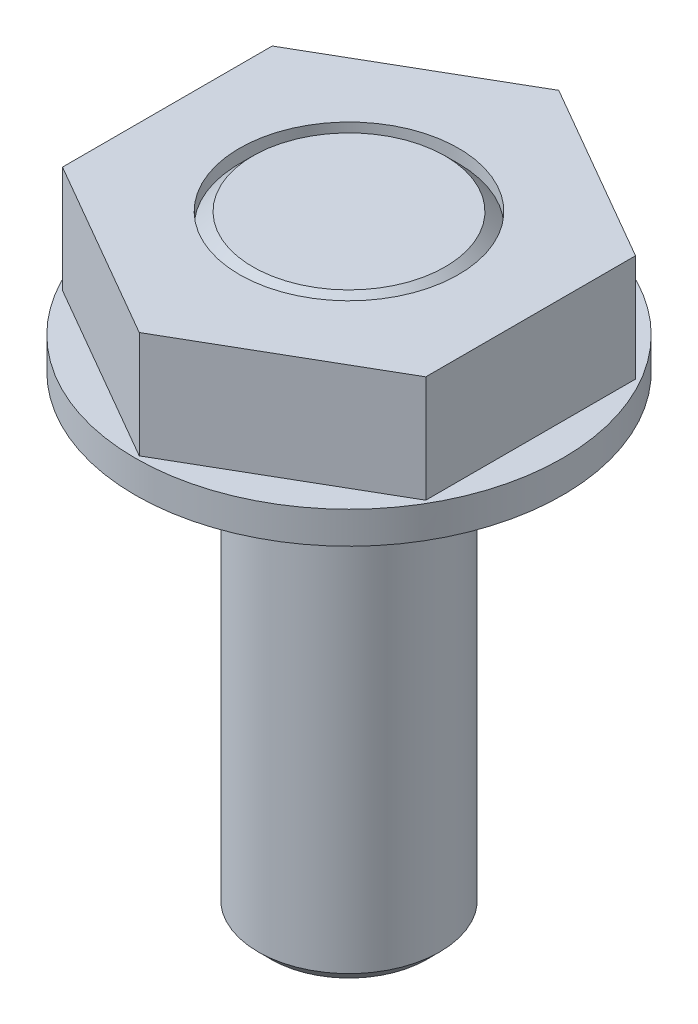
ISO-10303-21;
HEADER;
FILE_DESCRIPTION(('STEP AP214'),'2;1');
FILE_NAME('part.step','',(''),(''),'','','');
FILE_SCHEMA(('AUTOMOTIVE_DESIGN { 1 0 10303 214 1 1 1 1 }'));
ENDSEC;
DATA;
#1=APPLICATION_CONTEXT('core data for automotive mechanical design processes');
#2=APPLICATION_PROTOCOL_DEFINITION('international standard','automotive_design',2000,#1);
#3=PRODUCT_CONTEXT('',#1,'mechanical');
#4=PRODUCT('Part','Part','',(#3));
#5=PRODUCT_RELATED_PRODUCT_CATEGORY('part','',(#4));
#6=PRODUCT_DEFINITION_FORMATION('','',#4);
#7=PRODUCT_DEFINITION_CONTEXT('part definition',#1,'design');
#8=PRODUCT_DEFINITION('design','',#6,#7);
#9=PRODUCT_DEFINITION_SHAPE('','',#8);
#10=(LENGTH_UNIT() NAMED_UNIT(*) SI_UNIT(.MILLI.,.METRE.));
#11=(NAMED_UNIT(*) PLANE_ANGLE_UNIT() SI_UNIT($,.RADIAN.));
#12=(NAMED_UNIT(*) SI_UNIT($,.STERADIAN.) SOLID_ANGLE_UNIT());
#13=UNCERTAINTY_MEASURE_WITH_UNIT(LENGTH_MEASURE(1.E-05),#10,'distance_accuracy_value','');
#14=(GEOMETRIC_REPRESENTATION_CONTEXT(3) GLOBAL_UNCERTAINTY_ASSIGNED_CONTEXT((#13)) GLOBAL_UNIT_ASSIGNED_CONTEXT((#10,
#11,#12)) REPRESENTATION_CONTEXT('',''));
#15=CARTESIAN_POINT('',(0.,0.,0.));
#16=DIRECTION('',(0.,0.,1.));
#17=DIRECTION('',(1.,0.,0.));
#18=AXIS2_PLACEMENT_3D('',#15,#16,#17);
#19=CARTESIAN_POINT('',(-10.2732395765881,0.,-10.));
#20=DIRECTION('',(0.,-1.,0.));
#21=DIRECTION('',(1.,0.,0.));
#22=AXIS2_PLACEMENT_3D('',#19,#20,#21);
#23=PLANE('',#22);
#24=CARTESIAN_POINT('',(0.,0.,0.));
#25=DIRECTION('',(0.,-1.,0.));
#26=DIRECTION('',(0.,0.,1.));
#27=AXIS2_PLACEMENT_3D('',#24,#25,#26);
#28=CIRCLE('',#27,10.);
#29=CARTESIAN_POINT('',(0.,0.,10.));
#30=VERTEX_POINT('',#29);
#31=EDGE_CURVE('E181',#30,#30,#28,.T.);
#32=ORIENTED_EDGE('',*,*,#31,.T.);
#33=EDGE_LOOP('',(#32));
#34=FACE_BOUND('',#33,.T.);
#35=CARTESIAN_POINT('',(0.,0.,0.));
#36=DIRECTION('',(0.,1.,0.));
#37=DIRECTION('',(0.,0.,-1.));
#38=AXIS2_PLACEMENT_3D('',#35,#36,#37);
#39=CIRCLE('',#38,4.25);
#40=CARTESIAN_POINT('',(0.,0.,-4.25));
#41=VERTEX_POINT('',#40);
#42=EDGE_CURVE('E179',#41,#41,#39,.F.);
#43=ORIENTED_EDGE('',*,*,#42,.F.);
#44=EDGE_LOOP('',(#43));
#45=FACE_BOUND('',#44,.T.);
#46=ADVANCED_FACE('F16',(#34,#45),#23,.T.);
#47=CARTESIAN_POINT('',(-3.6365,-22.,-3.6365));
#48=DIRECTION('',(0.,-1.,0.));
#49=DIRECTION('',(1.,0.,0.));
#50=AXIS2_PLACEMENT_3D('',#47,#48,#49);
#51=PLANE('',#50);
#52=CARTESIAN_POINT('',(0.,-22.,0.));
#53=DIRECTION('',(0.,-1.,0.));
#54=DIRECTION('',(0.,0.,1.));
#55=AXIS2_PLACEMENT_3D('',#52,#53,#54);
#56=CIRCLE('',#55,3.6365);
#57=CARTESIAN_POINT('',(0.,-22.,3.6365));
#58=VERTEX_POINT('',#57);
#59=EDGE_CURVE('E96',#58,#58,#56,.T.);
#60=ORIENTED_EDGE('',*,*,#59,.T.);
#61=EDGE_LOOP('',(#60));
#62=FACE_BOUND('',#61,.T.);
#63=ADVANCED_FACE('F196',(#62),#51,.T.);
#64=CARTESIAN_POINT('',(-10.2732395705885,1.5,-10.));
#65=DIRECTION('',(0.,1.,0.));
#66=DIRECTION('',(0.,0.,1.));
#67=AXIS2_PLACEMENT_3D('',#64,#65,#66);
#68=PLANE('',#67);
#69=CARTESIAN_POINT('',(0.,1.5,0.));
#70=DIRECTION('',(0.,1.,0.));
#71=DIRECTION('',(0.,0.,-1.));
#72=AXIS2_PLACEMENT_3D('',#69,#70,#71);
#73=CIRCLE('',#72,10.);
#74=CARTESIAN_POINT('',(0.,1.5,-10.));
#75=VERTEX_POINT('',#74);
#76=EDGE_CURVE('E93',#75,#75,#73,.T.);
#77=ORIENTED_EDGE('',*,*,#76,.T.);
#78=EDGE_LOOP('',(#77));
#79=FACE_BOUND('',#78,.T.);
#80=DIRECTION('',(0.,0.,-1.));
#81=VECTOR('',#80,1.);
#82=CARTESIAN_POINT('',(-8.5,1.5,4.9074772881118));
#83=LINE('',#82,#81);
#84=CARTESIAN_POINT('',(-8.5,1.5,-4.9074772881118));
#85=VERTEX_POINT('',#84);
#86=CARTESIAN_POINT('',(-8.5,1.5,4.9074772881118));
#87=VERTEX_POINT('',#86);
#88=EDGE_CURVE('E79',#85,#87,#83,.F.);
#89=ORIENTED_EDGE('',*,*,#88,.F.);
#90=DIRECTION('',(0.866025403784439,0.,-0.499999999999999));
#91=VECTOR('',#90,1.);
#92=CARTESIAN_POINT('',(-8.5,1.5,-4.90747728811179));
#93=LINE('',#92,#91);
#94=CARTESIAN_POINT('',(0.,1.5,-9.8149545762236));
#95=VERTEX_POINT('',#94);
#96=EDGE_CURVE('E68',#95,#85,#93,.F.);
#97=ORIENTED_EDGE('',*,*,#96,.F.);
#98=DIRECTION('',(0.866025403784439,0.,0.499999999999999));
#99=VECTOR('',#98,1.);
#100=CARTESIAN_POINT('',(0.,1.5,-9.81495457622361));
#101=LINE('',#100,#99);
#102=CARTESIAN_POINT('',(8.50000000000001,1.5,-4.9074772881118));
#103=VERTEX_POINT('',#102);
#104=EDGE_CURVE('E78',#103,#95,#101,.F.);
#105=ORIENTED_EDGE('',*,*,#104,.F.);
#106=DIRECTION('',(0.,0.,1.));
#107=VECTOR('',#106,1.);
#108=CARTESIAN_POINT('',(8.50000000000001,1.5,-4.9074772881118));
#109=LINE('',#108,#107);
#110=CARTESIAN_POINT('',(8.50000000000001,1.5,4.9074772881118));
#111=VERTEX_POINT('',#110);
#112=EDGE_CURVE('E105',#111,#103,#109,.F.);
#113=ORIENTED_EDGE('',*,*,#112,.F.);
#114=DIRECTION('',(-0.866025403784439,0.,0.499999999999999));
#115=VECTOR('',#114,1.);
#116=CARTESIAN_POINT('',(8.49999999999999,1.5,4.90747728811179));
#117=LINE('',#116,#115);
#118=CARTESIAN_POINT('',(0.,1.5,9.8149545762236));
#119=VERTEX_POINT('',#118);
#120=EDGE_CURVE('E109',#119,#111,#117,.F.);
#121=ORIENTED_EDGE('',*,*,#120,.F.);
#122=DIRECTION('',(-0.866025403784439,0.,-0.5));
#123=VECTOR('',#122,1.);
#124=CARTESIAN_POINT('',(0.,1.5,9.81495457622361));
#125=LINE('',#124,#123);
#126=EDGE_CURVE('E92',#87,#119,#125,.F.);
#127=ORIENTED_EDGE('',*,*,#126,.F.);
#128=EDGE_LOOP('',(#89,#97,#105,#113,#121,#127));
#129=FACE_BOUND('',#128,.T.);
#130=ADVANCED_FACE('F90',(#79,#129),#68,.T.);
#131=CARTESIAN_POINT('',(-8.5,1.5,-4.9074772881118));
#132=DIRECTION('',(-1.,0.,0.));
#133=DIRECTION('',(0.,0.,1.));
#134=AXIS2_PLACEMENT_3D('',#131,#132,#133);
#135=PLANE('',#134);
#136=DIRECTION('',(0.,0.,-1.));
#137=VECTOR('',#136,1.);
#138=CARTESIAN_POINT('',(-8.5,6.5,4.9074772881118));
#139=LINE('',#138,#137);
#140=CARTESIAN_POINT('',(-8.5,6.5,-4.9074772881118));
#141=VERTEX_POINT('',#140);
#142=CARTESIAN_POINT('',(-8.5,6.5,4.9074772881118));
#143=VERTEX_POINT('',#142);
#144=EDGE_CURVE('E86',#141,#143,#139,.F.);
#145=ORIENTED_EDGE('',*,*,#144,.F.);
#146=DIRECTION('',(0.,-1.,0.));
#147=VECTOR('',#146,1.);
#148=CARTESIAN_POINT('',(-8.5,6.5,-4.9074772881118));
#149=LINE('',#148,#147);
#150=EDGE_CURVE('E72',#85,#141,#149,.F.);
#151=ORIENTED_EDGE('',*,*,#150,.F.);
#152=ORIENTED_EDGE('',*,*,#88,.T.);
#153=DIRECTION('',(0.,1.,0.));
#154=VECTOR('',#153,1.);
#155=CARTESIAN_POINT('',(-8.5,1.5,4.9074772881118));
#156=LINE('',#155,#154);
#157=EDGE_CURVE('E87',#87,#143,#156,.T.);
#158=ORIENTED_EDGE('',*,*,#157,.T.);
#159=EDGE_LOOP('',(#145,#151,#152,#158));
#160=FACE_BOUND('',#159,.T.);
#161=ADVANCED_FACE('F84',(#160),#135,.T.);
#162=CARTESIAN_POINT('',(0.,1.5,-9.8149545762236));
#163=DIRECTION('',(-0.499999999999999,0.,-0.866025403784439));
#164=DIRECTION('',(-0.866025403784439,0.,0.499999999999999));
#165=AXIS2_PLACEMENT_3D('',#162,#163,#164);
#166=PLANE('',#165);
#167=DIRECTION('',(0.866025403784439,0.,-0.499999999999999));
#168=VECTOR('',#167,1.);
#169=CARTESIAN_POINT('',(-8.5,6.5,-4.90747728811179));
#170=LINE('',#169,#168);
#171=CARTESIAN_POINT('',(0.,6.5,-9.8149545762236));
#172=VERTEX_POINT('',#171);
#173=EDGE_CURVE('E124',#172,#141,#170,.F.);
#174=ORIENTED_EDGE('',*,*,#173,.F.);
#175=DIRECTION('',(0.,-1.,0.));
#176=VECTOR('',#175,1.);
#177=CARTESIAN_POINT('',(0.,6.5,-9.8149545762236));
#178=LINE('',#177,#176);
#179=EDGE_CURVE('E74',#95,#172,#178,.F.);
#180=ORIENTED_EDGE('',*,*,#179,.F.);
#181=ORIENTED_EDGE('',*,*,#96,.T.);
#182=ORIENTED_EDGE('',*,*,#150,.T.);
#183=EDGE_LOOP('',(#174,#180,#181,#182));
#184=FACE_BOUND('',#183,.T.);
#185=ADVANCED_FACE('F71',(#184),#166,.T.);
#186=CARTESIAN_POINT('',(8.5,1.5,-4.9074772881118));
#187=DIRECTION('',(0.499999999999999,0.,-0.866025403784439));
#188=DIRECTION('',(-0.866025403784439,0.,-0.499999999999999));
#189=AXIS2_PLACEMENT_3D('',#186,#187,#188);
#190=PLANE('',#189);
#191=DIRECTION('',(0.866025403784439,0.,0.499999999999999));
#192=VECTOR('',#191,1.);
#193=CARTESIAN_POINT('',(0.,6.5,-9.81495457622361));
#194=LINE('',#193,#192);
#195=CARTESIAN_POINT('',(8.5,6.5,-4.9074772881118));
#196=VERTEX_POINT('',#195);
#197=EDGE_CURVE('E131',#196,#172,#194,.F.);
#198=ORIENTED_EDGE('',*,*,#197,.F.);
#199=DIRECTION('',(0.,-1.,0.));
#200=VECTOR('',#199,1.);
#201=CARTESIAN_POINT('',(8.5,6.5,-4.9074772881118));
#202=LINE('',#201,#200);
#203=EDGE_CURVE('E135',#103,#196,#202,.F.);
#204=ORIENTED_EDGE('',*,*,#203,.F.);
#205=ORIENTED_EDGE('',*,*,#104,.T.);
#206=ORIENTED_EDGE('',*,*,#179,.T.);
#207=EDGE_LOOP('',(#198,#204,#205,#206));
#208=FACE_BOUND('',#207,.T.);
#209=ADVANCED_FACE('F238',(#208),#190,.T.);
#210=CARTESIAN_POINT('',(8.5,1.5,4.9074772881118));
#211=DIRECTION('',(1.,0.,0.));
#212=DIRECTION('',(0.,0.,-1.));
#213=AXIS2_PLACEMENT_3D('',#210,#211,#212);
#214=PLANE('',#213);
#215=DIRECTION('',(0.,0.,1.));
#216=VECTOR('',#215,1.);
#217=CARTESIAN_POINT('',(8.5,6.5,-4.9074772881118));
#218=LINE('',#217,#216);
#219=CARTESIAN_POINT('',(8.5,6.5,4.9074772881118));
#220=VERTEX_POINT('',#219);
#221=EDGE_CURVE('E140',#220,#196,#218,.F.);
#222=ORIENTED_EDGE('',*,*,#221,.F.);
#223=DIRECTION('',(0.,-1.,0.));
#224=VECTOR('',#223,1.);
#225=CARTESIAN_POINT('',(8.5,6.5,4.9074772881118));
#226=LINE('',#225,#224);
#227=EDGE_CURVE('E144',#111,#220,#226,.F.);
#228=ORIENTED_EDGE('',*,*,#227,.F.);
#229=ORIENTED_EDGE('',*,*,#112,.T.);
#230=ORIENTED_EDGE('',*,*,#203,.T.);
#231=EDGE_LOOP('',(#222,#228,#229,#230));
#232=FACE_BOUND('',#231,.T.);
#233=ADVANCED_FACE('F247',(#232),#214,.T.);
#234=CARTESIAN_POINT('',(0.,1.5,9.8149545762236));
#235=DIRECTION('',(0.499999999999999,0.,0.866025403784439));
#236=DIRECTION('',(0.866025403784439,0.,-0.499999999999999));
#237=AXIS2_PLACEMENT_3D('',#234,#235,#236);
#238=PLANE('',#237);
#239=DIRECTION('',(-0.866025403784439,0.,0.499999999999999));
#240=VECTOR('',#239,1.);
#241=CARTESIAN_POINT('',(8.5,6.5,4.90747728811179));
#242=LINE('',#241,#240);
#243=CARTESIAN_POINT('',(0.,6.5,9.8149545762236));
#244=VERTEX_POINT('',#243);
#245=EDGE_CURVE('E35',#244,#220,#242,.F.);
#246=ORIENTED_EDGE('',*,*,#245,.F.);
#247=DIRECTION('',(0.,-1.,0.));
#248=VECTOR('',#247,1.);
#249=CARTESIAN_POINT('',(0.,6.5,9.8149545762236));
#250=LINE('',#249,#248);
#251=EDGE_CURVE('E152',#119,#244,#250,.F.);
#252=ORIENTED_EDGE('',*,*,#251,.F.);
#253=ORIENTED_EDGE('',*,*,#120,.T.);
#254=ORIENTED_EDGE('',*,*,#227,.T.);
#255=EDGE_LOOP('',(#246,#252,#253,#254));
#256=FACE_BOUND('',#255,.T.);
#257=ADVANCED_FACE('F257',(#256),#238,.T.);
#258=CARTESIAN_POINT('',(-8.5,1.5,4.9074772881118));
#259=DIRECTION('',(-0.499999999999999,0.,0.866025403784439));
#260=DIRECTION('',(0.866025403784439,0.,0.499999999999999));
#261=AXIS2_PLACEMENT_3D('',#258,#259,#260);
#262=PLANE('',#261);
#263=DIRECTION('',(-0.866025403784439,0.,-0.499999999999999));
#264=VECTOR('',#263,1.);
#265=CARTESIAN_POINT('',(0.,6.5,9.81495457622361));
#266=LINE('',#265,#264);
#267=EDGE_CURVE('E31',#143,#244,#266,.F.);
#268=ORIENTED_EDGE('',*,*,#267,.F.);
#269=ORIENTED_EDGE('',*,*,#157,.F.);
#270=ORIENTED_EDGE('',*,*,#126,.T.);
#271=ORIENTED_EDGE('',*,*,#251,.T.);
#272=EDGE_LOOP('',(#268,#269,#270,#271));
#273=FACE_BOUND('',#272,.T.);
#274=ADVANCED_FACE('F267',(#273),#262,.T.);
#275=CARTESIAN_POINT('',(-8.5,6.5,9.81495457622361));
#276=DIRECTION('',(0.,1.,0.));
#277=DIRECTION('',(1.,0.,0.));
#278=AXIS2_PLACEMENT_3D('',#275,#276,#277);
#279=PLANE('',#278);
#280=ORIENTED_EDGE('',*,*,#221,.T.);
#281=ORIENTED_EDGE('',*,*,#197,.T.);
#282=ORIENTED_EDGE('',*,*,#173,.T.);
#283=ORIENTED_EDGE('',*,*,#144,.T.);
#284=ORIENTED_EDGE('',*,*,#267,.T.);
#285=ORIENTED_EDGE('',*,*,#245,.T.);
#286=EDGE_LOOP('',(#280,#281,#282,#283,#284,#285));
#287=FACE_BOUND('',#286,.T.);
#288=CARTESIAN_POINT('',(0.,6.5,0.));
#289=DIRECTION('',(0.,-1.,0.));
#290=DIRECTION('',(0.,0.,1.));
#291=AXIS2_PLACEMENT_3D('',#288,#289,#290);
#292=CIRCLE('',#291,5.125);
#293=CARTESIAN_POINT('',(0.,6.5,5.125));
#294=VERTEX_POINT('',#293);
#295=EDGE_CURVE('E160',#294,#294,#292,.T.);
#296=ORIENTED_EDGE('',*,*,#295,.T.);
#297=EDGE_LOOP('',(#296));
#298=FACE_BOUND('',#297,.T.);
#299=ADVANCED_FACE('F277',(#287,#298),#279,.T.);
#300=CARTESIAN_POINT('',(-4.5,6.5,4.5));
#301=DIRECTION('',(0.,1.,0.));
#302=DIRECTION('',(1.,0.,0.));
#303=AXIS2_PLACEMENT_3D('',#300,#301,#302);
#304=PLANE('',#303);
#305=CARTESIAN_POINT('',(0.,6.5,0.));
#306=DIRECTION('',(0.,1.,0.));
#307=DIRECTION('',(0.,0.,-1.));
#308=AXIS2_PLACEMENT_3D('',#305,#306,#307);
#309=CIRCLE('',#308,4.5);
#310=CARTESIAN_POINT('',(0.,6.5,-4.5));
#311=VERTEX_POINT('',#310);
#312=EDGE_CURVE('E165',#311,#311,#309,.F.);
#313=ORIENTED_EDGE('',*,*,#312,.F.);
#314=EDGE_LOOP('',(#313));
#315=FACE_BOUND('',#314,.T.);
#316=ADVANCED_FACE('F191',(#315),#304,.T.);
#317=CARTESIAN_POINT('',(0.,-22.,0.));
#318=DIRECTION('',(0.,-1.,0.));
#319=DIRECTION('',(1.16842947573567E-09,0.,1.));
#320=AXIS2_PLACEMENT_3D('',#317,#318,#319);
#321=CYLINDRICAL_SURFACE('',#320,10.);
#322=ORIENTED_EDGE('',*,*,#31,.F.);
#323=EDGE_LOOP('',(#322));
#324=FACE_BOUND('',#323,.T.);
#325=ORIENTED_EDGE('',*,*,#76,.F.);
#326=EDGE_LOOP('',(#325));
#327=FACE_BOUND('',#326,.T.);
#328=ADVANCED_FACE('F175',(#324,#327),#321,.T.);
#329=CARTESIAN_POINT('',(0.,-22.,0.));
#330=DIRECTION('',(0.,-1.,0.));
#331=DIRECTION('',(1.4205390920264E-07,0.,0.99999999999999));
#332=AXIS2_PLACEMENT_3D('',#329,#330,#331);
#333=CYLINDRICAL_SURFACE('',#332,4.25);
#334=CARTESIAN_POINT('',(0.,-21.3865,0.));
#335=DIRECTION('',(0.,1.,0.));
#336=DIRECTION('',(0.,0.,-1.));
#337=AXIS2_PLACEMENT_3D('',#334,#335,#336);
#338=CIRCLE('',#337,4.25);
#339=CARTESIAN_POINT('',(0.,-21.3865,-4.25));
#340=VERTEX_POINT('',#339);
#341=EDGE_CURVE('E24',#340,#340,#338,.F.);
#342=ORIENTED_EDGE('',*,*,#341,.F.);
#343=EDGE_LOOP('',(#342));
#344=FACE_BOUND('',#343,.T.);
#345=ORIENTED_EDGE('',*,*,#42,.T.);
#346=EDGE_LOOP('',(#345));
#347=FACE_BOUND('',#346,.T.);
#348=ADVANCED_FACE('F172',(#344,#347),#333,.T.);
#349=CARTESIAN_POINT('',(0.,-21.3865,0.));
#350=DIRECTION('',(0.,1.,0.));
#351=DIRECTION('',(0.,0.,-1.));
#352=AXIS2_PLACEMENT_3D('',#349,#350,#351);
#353=CONICAL_SURFACE('',#352,4.25,0.785398163397452);
#354=ORIENTED_EDGE('',*,*,#59,.F.);
#355=EDGE_LOOP('',(#354));
#356=FACE_BOUND('',#355,.T.);
#357=ORIENTED_EDGE('',*,*,#341,.T.);
#358=EDGE_LOOP('',(#357));
#359=FACE_BOUND('',#358,.T.);
#360=ADVANCED_FACE('F170',(#356,#359),#353,.T.);
#361=CARTESIAN_POINT('',(0.,5.875,0.));
#362=DIRECTION('',(0.,-1.,0.));
#363=DIRECTION('',(1.92338267875211E-10,0.,1.));
#364=AXIS2_PLACEMENT_3D('',#361,#362,#363);
#365=CONICAL_SURFACE('',#364,5.125,0.785398163397448);
#366=CARTESIAN_POINT('',(0.,5.875,0.));
#367=DIRECTION('',(0.,1.,0.));
#368=DIRECTION('',(0.,0.,-1.));
#369=AXIS2_PLACEMENT_3D('',#366,#367,#368);
#370=CIRCLE('',#369,5.125);
#371=CARTESIAN_POINT('',(0.,5.875,-5.125));
#372=VERTEX_POINT('',#371);
#373=EDGE_CURVE('E11',#372,#372,#370,.F.);
#374=ORIENTED_EDGE('',*,*,#373,.F.);
#375=EDGE_LOOP('',(#374));
#376=FACE_BOUND('',#375,.T.);
#377=ORIENTED_EDGE('',*,*,#312,.T.);
#378=EDGE_LOOP('',(#377));
#379=FACE_BOUND('',#378,.T.);
#380=ADVANCED_FACE('F316',(#376,#379),#365,.T.);
#381=CARTESIAN_POINT('',(0.,1.5,0.));
#382=DIRECTION('',(0.,-1.,0.));
#383=DIRECTION('',(1.92338267875211E-10,0.,1.));
#384=AXIS2_PLACEMENT_3D('',#381,#382,#383);
#385=CYLINDRICAL_SURFACE('',#384,5.125);
#386=ORIENTED_EDGE('',*,*,#295,.F.);
#387=EDGE_LOOP('',(#386));
#388=FACE_BOUND('',#387,.T.);
#389=ORIENTED_EDGE('',*,*,#373,.T.);
#390=EDGE_LOOP('',(#389));
#391=FACE_BOUND('',#390,.T.);
#392=ADVANCED_FACE('F18',(#388,#391),#385,.F.);
#393=CLOSED_SHELL('',(#46,#63,#130,#161,#185,#209,#233,#257,#274,#299,#316,#328,#348,#360,#380,#392));
#394=MANIFOLD_SOLID_BREP('B1',#393);
#395=ADVANCED_BREP_SHAPE_REPRESENTATION('',(#18,#394),#14);
#396=SHAPE_DEFINITION_REPRESENTATION(#9,#395);
ENDSEC;
END-ISO-10303-21;
